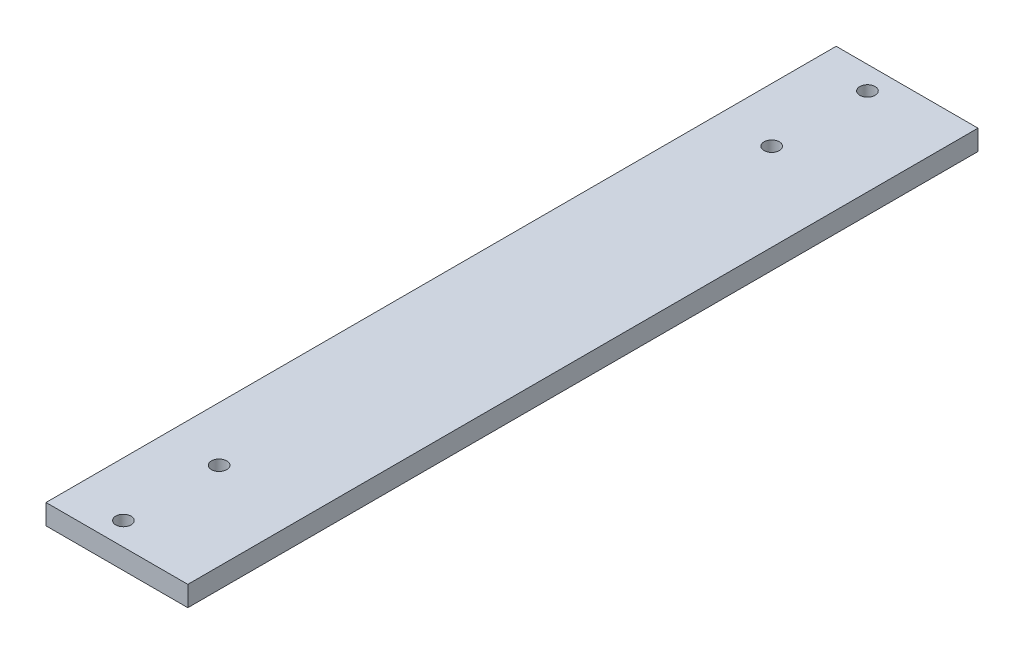
ISO-10303-21;
HEADER;
FILE_DESCRIPTION(('STEP AP214'),'2;1');
FILE_NAME('part.step','',(''),(''),'','','');
FILE_SCHEMA(('AUTOMOTIVE_DESIGN { 1 0 10303 214 1 1 1 1 }'));
ENDSEC;
DATA;
#1=APPLICATION_CONTEXT('core data for automotive mechanical design processes');
#2=APPLICATION_PROTOCOL_DEFINITION('international standard','automotive_design',2000,#1);
#3=PRODUCT_CONTEXT('',#1,'mechanical');
#4=PRODUCT('Part','Part','',(#3));
#5=PRODUCT_RELATED_PRODUCT_CATEGORY('part','',(#4));
#6=PRODUCT_DEFINITION_FORMATION('','',#4);
#7=PRODUCT_DEFINITION_CONTEXT('part definition',#1,'design');
#8=PRODUCT_DEFINITION('design','',#6,#7);
#9=PRODUCT_DEFINITION_SHAPE('','',#8);
#10=(LENGTH_UNIT() NAMED_UNIT(*) SI_UNIT(.MILLI.,.METRE.));
#11=(NAMED_UNIT(*) PLANE_ANGLE_UNIT() SI_UNIT($,.RADIAN.));
#12=(NAMED_UNIT(*) SI_UNIT($,.STERADIAN.) SOLID_ANGLE_UNIT());
#13=UNCERTAINTY_MEASURE_WITH_UNIT(LENGTH_MEASURE(1.E-05),#10,'distance_accuracy_value','');
#14=(GEOMETRIC_REPRESENTATION_CONTEXT(3) GLOBAL_UNCERTAINTY_ASSIGNED_CONTEXT((#13)) GLOBAL_UNIT_ASSIGNED_CONTEXT((#10,
#11,#12)) REPRESENTATION_CONTEXT('',''));
#15=CARTESIAN_POINT('',(0.,0.,0.));
#16=DIRECTION('',(0.,0.,1.));
#17=DIRECTION('',(1.,0.,0.));
#18=AXIS2_PLACEMENT_3D('',#15,#16,#17);
#19=CARTESIAN_POINT('',(22.225,6.35,123.825));
#20=DIRECTION('',(-1.,0.,0.));
#21=DIRECTION('',(0.,0.,1.));
#22=AXIS2_PLACEMENT_3D('',#19,#20,#21);
#23=PLANE('',#22);
#24=DIRECTION('',(0.,0.,-1.));
#25=VECTOR('',#24,1.);
#26=CARTESIAN_POINT('',(22.225,0.,123.825));
#27=LINE('',#26,#25);
#28=CARTESIAN_POINT('',(22.225,0.,123.825));
#29=VERTEX_POINT('',#28);
#30=CARTESIAN_POINT('',(22.225,0.,-123.825));
#31=VERTEX_POINT('',#30);
#32=EDGE_CURVE('E98',#29,#31,#27,.T.);
#33=ORIENTED_EDGE('',*,*,#32,.T.);
#34=DIRECTION('',(0.,-1.,0.));
#35=VECTOR('',#34,1.);
#36=CARTESIAN_POINT('',(22.225,6.35,-123.825));
#37=LINE('',#36,#35);
#38=CARTESIAN_POINT('',(22.225,6.35,-123.825));
#39=VERTEX_POINT('',#38);
#40=EDGE_CURVE('E11',#39,#31,#37,.T.);
#41=ORIENTED_EDGE('',*,*,#40,.F.);
#42=DIRECTION('',(0.,0.,-1.));
#43=VECTOR('',#42,1.);
#44=CARTESIAN_POINT('',(22.225,6.35,123.825));
#45=LINE('',#44,#43);
#46=CARTESIAN_POINT('',(22.225,6.35,123.825));
#47=VERTEX_POINT('',#46);
#48=EDGE_CURVE('E86',#47,#39,#45,.T.);
#49=ORIENTED_EDGE('',*,*,#48,.F.);
#50=DIRECTION('',(0.,-1.,0.));
#51=VECTOR('',#50,1.);
#52=CARTESIAN_POINT('',(22.225,6.35,123.825));
#53=LINE('',#52,#51);
#54=EDGE_CURVE('E94',#47,#29,#53,.T.);
#55=ORIENTED_EDGE('',*,*,#54,.T.);
#56=EDGE_LOOP('',(#33,#41,#49,#55));
#57=FACE_BOUND('',#56,.T.);
#58=ADVANCED_FACE('F35',(#57),#23,.F.);
#59=CARTESIAN_POINT('',(-22.225,6.35,-123.825));
#60=DIRECTION('',(0.,0.,1.));
#61=DIRECTION('',(1.,0.,0.));
#62=AXIS2_PLACEMENT_3D('',#59,#60,#61);
#63=PLANE('',#62);
#64=DIRECTION('',(-1.,0.,0.));
#65=VECTOR('',#64,1.);
#66=CARTESIAN_POINT('',(-22.225,0.,-123.825));
#67=LINE('',#66,#65);
#68=CARTESIAN_POINT('',(-22.225,0.,-123.825));
#69=VERTEX_POINT('',#68);
#70=EDGE_CURVE('E90',#31,#69,#67,.T.);
#71=ORIENTED_EDGE('',*,*,#70,.T.);
#72=DIRECTION('',(0.,-1.,0.));
#73=VECTOR('',#72,1.);
#74=CARTESIAN_POINT('',(-22.225,6.35,-123.825));
#75=LINE('',#74,#73);
#76=CARTESIAN_POINT('',(-22.225,6.35,-123.825));
#77=VERTEX_POINT('',#76);
#78=EDGE_CURVE('E43',#77,#69,#75,.T.);
#79=ORIENTED_EDGE('',*,*,#78,.F.);
#80=DIRECTION('',(-1.,0.,0.));
#81=VECTOR('',#80,1.);
#82=CARTESIAN_POINT('',(-22.225,6.35,-123.825));
#83=LINE('',#82,#81);
#84=EDGE_CURVE('E81',#39,#77,#83,.T.);
#85=ORIENTED_EDGE('',*,*,#84,.F.);
#86=ORIENTED_EDGE('',*,*,#40,.T.);
#87=EDGE_LOOP('',(#71,#79,#85,#86));
#88=FACE_BOUND('',#87,.T.);
#89=ADVANCED_FACE('F89',(#88),#63,.F.);
#90=CARTESIAN_POINT('',(-22.225,6.35,123.825));
#91=DIRECTION('',(1.,0.,0.));
#92=DIRECTION('',(0.,0.,-1.));
#93=AXIS2_PLACEMENT_3D('',#90,#91,#92);
#94=PLANE('',#93);
#95=DIRECTION('',(0.,0.,1.));
#96=VECTOR('',#95,1.);
#97=CARTESIAN_POINT('',(-22.225,0.,123.825));
#98=LINE('',#97,#96);
#99=CARTESIAN_POINT('',(-22.225,0.,123.825));
#100=VERTEX_POINT('',#99);
#101=EDGE_CURVE('E68',#69,#100,#98,.T.);
#102=ORIENTED_EDGE('',*,*,#101,.T.);
#103=DIRECTION('',(0.,-1.,0.));
#104=VECTOR('',#103,1.);
#105=CARTESIAN_POINT('',(-22.225,6.35,123.825));
#106=LINE('',#105,#104);
#107=CARTESIAN_POINT('',(-22.225,6.35,123.825));
#108=VERTEX_POINT('',#107);
#109=EDGE_CURVE('E91',#108,#100,#106,.T.);
#110=ORIENTED_EDGE('',*,*,#109,.F.);
#111=DIRECTION('',(0.,0.,1.));
#112=VECTOR('',#111,1.);
#113=CARTESIAN_POINT('',(-22.225,6.35,123.825));
#114=LINE('',#113,#112);
#115=EDGE_CURVE('E84',#77,#108,#114,.T.);
#116=ORIENTED_EDGE('',*,*,#115,.F.);
#117=ORIENTED_EDGE('',*,*,#78,.T.);
#118=EDGE_LOOP('',(#102,#110,#116,#117));
#119=FACE_BOUND('',#118,.T.);
#120=ADVANCED_FACE('F92',(#119),#94,.F.);
#121=CARTESIAN_POINT('',(-22.225,6.35,123.825));
#122=DIRECTION('',(0.,0.,-1.));
#123=DIRECTION('',(-1.,0.,0.));
#124=AXIS2_PLACEMENT_3D('',#121,#122,#123);
#125=PLANE('',#124);
#126=DIRECTION('',(1.,0.,0.));
#127=VECTOR('',#126,1.);
#128=CARTESIAN_POINT('',(-22.225,0.,123.825));
#129=LINE('',#128,#127);
#130=EDGE_CURVE('E74',#100,#29,#129,.T.);
#131=ORIENTED_EDGE('',*,*,#130,.T.);
#132=ORIENTED_EDGE('',*,*,#54,.F.);
#133=DIRECTION('',(1.,0.,0.));
#134=VECTOR('',#133,1.);
#135=CARTESIAN_POINT('',(-22.225,6.35,123.825));
#136=LINE('',#135,#134);
#137=EDGE_CURVE('E51',#108,#47,#136,.T.);
#138=ORIENTED_EDGE('',*,*,#137,.F.);
#139=ORIENTED_EDGE('',*,*,#109,.T.);
#140=EDGE_LOOP('',(#131,#132,#138,#139));
#141=FACE_BOUND('',#140,.T.);
#142=ADVANCED_FACE('F106',(#141),#125,.F.);
#143=CARTESIAN_POINT('',(0.,6.35,0.));
#144=DIRECTION('',(0.,-1.,0.));
#145=DIRECTION('',(0.,0.,-1.));
#146=AXIS2_PLACEMENT_3D('',#143,#144,#145);
#147=PLANE('',#146);
#148=CARTESIAN_POINT('',(-5.19999999999999,6.35,116.6));
#149=DIRECTION('',(0.,-1.,0.));
#150=DIRECTION('',(0.,0.,-1.));
#151=AXIS2_PLACEMENT_3D('',#148,#149,#150);
#152=CIRCLE('',#151,2.4);
#153=CARTESIAN_POINT('',(-5.19999999999999,6.35,114.2));
#154=VERTEX_POINT('',#153);
#155=EDGE_CURVE('E129',#154,#154,#152,.T.);
#156=ORIENTED_EDGE('',*,*,#155,.T.);
#157=EDGE_LOOP('',(#156));
#158=FACE_BOUND('',#157,.T.);
#159=CARTESIAN_POINT('',(-5.19999999999999,6.35,86.5999999999999));
#160=DIRECTION('',(0.,-1.,0.));
#161=DIRECTION('',(0.,0.,-1.));
#162=AXIS2_PLACEMENT_3D('',#159,#160,#161);
#163=CIRCLE('',#162,2.4);
#164=CARTESIAN_POINT('',(-5.19999999999999,6.35,84.1999999999999));
#165=VERTEX_POINT('',#164);
#166=EDGE_CURVE('E123',#165,#165,#163,.T.);
#167=ORIENTED_EDGE('',*,*,#166,.T.);
#168=EDGE_LOOP('',(#167));
#169=FACE_BOUND('',#168,.T.);
#170=CARTESIAN_POINT('',(-5.19999999999999,6.35,-116.6));
#171=DIRECTION('',(0.,-1.,0.));
#172=DIRECTION('',(0.,0.,-1.));
#173=AXIS2_PLACEMENT_3D('',#170,#171,#172);
#174=CIRCLE('',#173,2.4);
#175=CARTESIAN_POINT('',(-5.19999999999999,6.35,-119.));
#176=VERTEX_POINT('',#175);
#177=EDGE_CURVE('E117',#176,#176,#174,.T.);
#178=ORIENTED_EDGE('',*,*,#177,.T.);
#179=EDGE_LOOP('',(#178));
#180=FACE_BOUND('',#179,.T.);
#181=CARTESIAN_POINT('',(-5.19999999999999,6.35,-86.6));
#182=DIRECTION('',(0.,-1.,0.));
#183=DIRECTION('',(0.,0.,-1.));
#184=AXIS2_PLACEMENT_3D('',#181,#182,#183);
#185=CIRCLE('',#184,2.4);
#186=CARTESIAN_POINT('',(-5.19999999999999,6.35,-89.));
#187=VERTEX_POINT('',#186);
#188=EDGE_CURVE('E101',#187,#187,#185,.T.);
#189=ORIENTED_EDGE('',*,*,#188,.T.);
#190=EDGE_LOOP('',(#189));
#191=FACE_BOUND('',#190,.T.);
#192=ORIENTED_EDGE('',*,*,#48,.T.);
#193=ORIENTED_EDGE('',*,*,#84,.T.);
#194=ORIENTED_EDGE('',*,*,#115,.T.);
#195=ORIENTED_EDGE('',*,*,#137,.T.);
#196=EDGE_LOOP('',(#192,#193,#194,#195));
#197=FACE_BOUND('',#196,.T.);
#198=ADVANCED_FACE('F82',(#158,#169,#180,#191,#197),#147,.F.);
#199=CARTESIAN_POINT('',(0.,0.,0.));
#200=DIRECTION('',(0.,-1.,0.));
#201=DIRECTION('',(0.,0.,-1.));
#202=AXIS2_PLACEMENT_3D('',#199,#200,#201);
#203=PLANE('',#202);
#204=CARTESIAN_POINT('',(-5.19999999999999,0.,116.6));
#205=DIRECTION('',(0.,-1.,0.));
#206=DIRECTION('',(0.,0.,-1.));
#207=AXIS2_PLACEMENT_3D('',#204,#205,#206);
#208=CIRCLE('',#207,2.4);
#209=CARTESIAN_POINT('',(-5.19999999999999,0.,114.2));
#210=VERTEX_POINT('',#209);
#211=EDGE_CURVE('E132',#210,#210,#208,.T.);
#212=ORIENTED_EDGE('',*,*,#211,.F.);
#213=EDGE_LOOP('',(#212));
#214=FACE_BOUND('',#213,.T.);
#215=CARTESIAN_POINT('',(-5.19999999999999,0.,86.5999999999999));
#216=DIRECTION('',(0.,-1.,0.));
#217=DIRECTION('',(0.,0.,-1.));
#218=AXIS2_PLACEMENT_3D('',#215,#216,#217);
#219=CIRCLE('',#218,2.4);
#220=CARTESIAN_POINT('',(-5.19999999999999,0.,84.1999999999999));
#221=VERTEX_POINT('',#220);
#222=EDGE_CURVE('E126',#221,#221,#219,.T.);
#223=ORIENTED_EDGE('',*,*,#222,.F.);
#224=EDGE_LOOP('',(#223));
#225=FACE_BOUND('',#224,.T.);
#226=CARTESIAN_POINT('',(-5.19999999999999,0.,-116.6));
#227=DIRECTION('',(0.,-1.,0.));
#228=DIRECTION('',(0.,0.,-1.));
#229=AXIS2_PLACEMENT_3D('',#226,#227,#228);
#230=CIRCLE('',#229,2.4);
#231=CARTESIAN_POINT('',(-5.19999999999999,0.,-119.));
#232=VERTEX_POINT('',#231);
#233=EDGE_CURVE('E120',#232,#232,#230,.T.);
#234=ORIENTED_EDGE('',*,*,#233,.F.);
#235=EDGE_LOOP('',(#234));
#236=FACE_BOUND('',#235,.T.);
#237=CARTESIAN_POINT('',(-5.19999999999999,0.,-86.6));
#238=DIRECTION('',(0.,-1.,0.));
#239=DIRECTION('',(0.,0.,-1.));
#240=AXIS2_PLACEMENT_3D('',#237,#238,#239);
#241=CIRCLE('',#240,2.4);
#242=CARTESIAN_POINT('',(-5.19999999999999,0.,-89.));
#243=VERTEX_POINT('',#242);
#244=EDGE_CURVE('E114',#243,#243,#241,.T.);
#245=ORIENTED_EDGE('',*,*,#244,.F.);
#246=EDGE_LOOP('',(#245));
#247=FACE_BOUND('',#246,.T.);
#248=ORIENTED_EDGE('',*,*,#32,.F.);
#249=ORIENTED_EDGE('',*,*,#130,.F.);
#250=ORIENTED_EDGE('',*,*,#101,.F.);
#251=ORIENTED_EDGE('',*,*,#70,.F.);
#252=EDGE_LOOP('',(#248,#249,#250,#251));
#253=FACE_BOUND('',#252,.T.);
#254=ADVANCED_FACE('F109',(#214,#225,#236,#247,#253),#203,.T.);
#255=CARTESIAN_POINT('',(-5.19999999999999,0.,-86.6));
#256=DIRECTION('',(0.,-1.,0.));
#257=DIRECTION('',(0.,0.,-1.));
#258=AXIS2_PLACEMENT_3D('',#255,#256,#257);
#259=CYLINDRICAL_SURFACE('',#258,2.4);
#260=ORIENTED_EDGE('',*,*,#188,.F.);
#261=EDGE_LOOP('',(#260));
#262=FACE_BOUND('',#261,.T.);
#263=ORIENTED_EDGE('',*,*,#244,.T.);
#264=EDGE_LOOP('',(#263));
#265=FACE_BOUND('',#264,.T.);
#266=ADVANCED_FACE('F140',(#262,#265),#259,.F.);
#267=CARTESIAN_POINT('',(-5.19999999999999,0.,-116.6));
#268=DIRECTION('',(0.,-1.,0.));
#269=DIRECTION('',(0.,0.,-1.));
#270=AXIS2_PLACEMENT_3D('',#267,#268,#269);
#271=CYLINDRICAL_SURFACE('',#270,2.4);
#272=ORIENTED_EDGE('',*,*,#177,.F.);
#273=EDGE_LOOP('',(#272));
#274=FACE_BOUND('',#273,.T.);
#275=ORIENTED_EDGE('',*,*,#233,.T.);
#276=EDGE_LOOP('',(#275));
#277=FACE_BOUND('',#276,.T.);
#278=ADVANCED_FACE('F149',(#274,#277),#271,.F.);
#279=CARTESIAN_POINT('',(-5.19999999999999,0.,86.5999999999999));
#280=DIRECTION('',(0.,-1.,0.));
#281=DIRECTION('',(0.,0.,-1.));
#282=AXIS2_PLACEMENT_3D('',#279,#280,#281);
#283=CYLINDRICAL_SURFACE('',#282,2.4);
#284=ORIENTED_EDGE('',*,*,#166,.F.);
#285=EDGE_LOOP('',(#284));
#286=FACE_BOUND('',#285,.T.);
#287=ORIENTED_EDGE('',*,*,#222,.T.);
#288=EDGE_LOOP('',(#287));
#289=FACE_BOUND('',#288,.T.);
#290=ADVANCED_FACE('F155',(#286,#289),#283,.F.);
#291=CARTESIAN_POINT('',(-5.19999999999999,0.,116.6));
#292=DIRECTION('',(0.,-1.,0.));
#293=DIRECTION('',(0.,0.,-1.));
#294=AXIS2_PLACEMENT_3D('',#291,#292,#293);
#295=CYLINDRICAL_SURFACE('',#294,2.4);
#296=ORIENTED_EDGE('',*,*,#155,.F.);
#297=EDGE_LOOP('',(#296));
#298=FACE_BOUND('',#297,.T.);
#299=ORIENTED_EDGE('',*,*,#211,.T.);
#300=EDGE_LOOP('',(#299));
#301=FACE_BOUND('',#300,.T.);
#302=ADVANCED_FACE('F136',(#298,#301),#295,.F.);
#303=CLOSED_SHELL('',(#58,#89,#120,#142,#198,#254,#266,#278,#290,#302));
#304=MANIFOLD_SOLID_BREP('B2',#303);
#305=ADVANCED_BREP_SHAPE_REPRESENTATION('',(#18,#304),#14);
#306=SHAPE_DEFINITION_REPRESENTATION(#9,#305);
ENDSEC;
END-ISO-10303-21;
